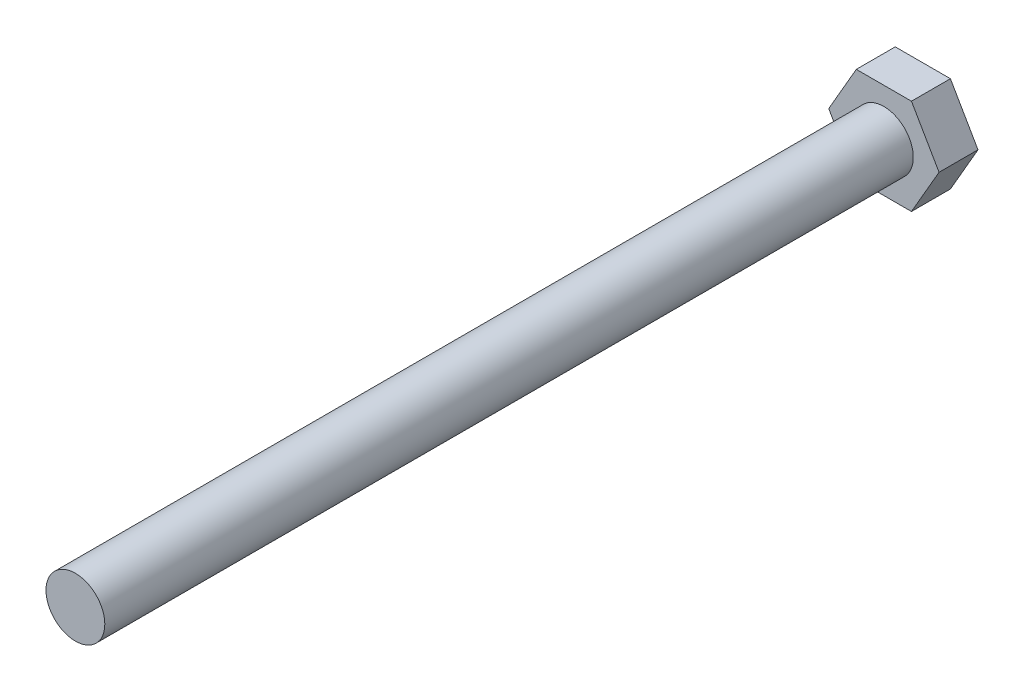
ISO-10303-21;
HEADER;
FILE_DESCRIPTION(('STEP AP214'),'2;1');
FILE_NAME('part.step','',(''),(''),'','','');
FILE_SCHEMA(('AUTOMOTIVE_DESIGN { 1 0 10303 214 1 1 1 1 }'));
ENDSEC;
DATA;
#1=APPLICATION_CONTEXT('core data for automotive mechanical design processes');
#2=APPLICATION_PROTOCOL_DEFINITION('international standard','automotive_design',2000,#1);
#3=PRODUCT_CONTEXT('',#1,'mechanical');
#4=PRODUCT('Part','Part','',(#3));
#5=PRODUCT_RELATED_PRODUCT_CATEGORY('part','',(#4));
#6=PRODUCT_DEFINITION_FORMATION('','',#4);
#7=PRODUCT_DEFINITION_CONTEXT('part definition',#1,'design');
#8=PRODUCT_DEFINITION('design','',#6,#7);
#9=PRODUCT_DEFINITION_SHAPE('','',#8);
#10=(LENGTH_UNIT() NAMED_UNIT(*) SI_UNIT(.MILLI.,.METRE.));
#11=(NAMED_UNIT(*) PLANE_ANGLE_UNIT() SI_UNIT($,.RADIAN.));
#12=(NAMED_UNIT(*) SI_UNIT($,.STERADIAN.) SOLID_ANGLE_UNIT());
#13=UNCERTAINTY_MEASURE_WITH_UNIT(LENGTH_MEASURE(1.E-05),#10,'distance_accuracy_value','');
#14=(GEOMETRIC_REPRESENTATION_CONTEXT(3) GLOBAL_UNCERTAINTY_ASSIGNED_CONTEXT((#13)) GLOBAL_UNIT_ASSIGNED_CONTEXT((#10,
#11,#12)) REPRESENTATION_CONTEXT('',''));
#15=CARTESIAN_POINT('',(0.,0.,0.));
#16=DIRECTION('',(0.,0.,1.));
#17=DIRECTION('',(1.,0.,0.));
#18=AXIS2_PLACEMENT_3D('',#15,#16,#17);
#19=CARTESIAN_POINT('',(3.75277674973257,-6.5,5.3));
#20=DIRECTION('',(0.,0.,-1.));
#21=DIRECTION('',(-1.,0.,0.));
#22=AXIS2_PLACEMENT_3D('',#19,#20,#21);
#23=PLANE('',#22);
#24=DIRECTION('',(0.5,0.866025403784439,0.));
#25=VECTOR('',#24,1.);
#26=CARTESIAN_POINT('',(3.75277674973257,-6.5,5.3));
#27=LINE('',#26,#25);
#28=CARTESIAN_POINT('',(3.75277674973257,-6.5,5.3));
#29=VERTEX_POINT('',#28);
#30=CARTESIAN_POINT('',(7.50555349946513,0.,5.3));
#31=VERTEX_POINT('',#30);
#32=EDGE_CURVE('E136',#29,#31,#27,.T.);
#33=ORIENTED_EDGE('',*,*,#32,.T.);
#34=DIRECTION('',(-0.5,0.866025403784439,0.));
#35=VECTOR('',#34,1.);
#36=CARTESIAN_POINT('',(7.50555349946513,0.,5.3));
#37=LINE('',#36,#35);
#38=CARTESIAN_POINT('',(3.75277674973257,6.5,5.3));
#39=VERTEX_POINT('',#38);
#40=EDGE_CURVE('E94',#31,#39,#37,.T.);
#41=ORIENTED_EDGE('',*,*,#40,.T.);
#42=DIRECTION('',(-1.,0.,0.));
#43=VECTOR('',#42,1.);
#44=CARTESIAN_POINT('',(3.75277674973257,6.5,5.3));
#45=LINE('',#44,#43);
#46=CARTESIAN_POINT('',(-3.75277674973257,6.5,5.3));
#47=VERTEX_POINT('',#46);
#48=EDGE_CURVE('E107',#39,#47,#45,.T.);
#49=ORIENTED_EDGE('',*,*,#48,.T.);
#50=DIRECTION('',(-0.5,-0.866025403784439,0.));
#51=VECTOR('',#50,1.);
#52=CARTESIAN_POINT('',(-3.75277674973257,6.5,5.3));
#53=LINE('',#52,#51);
#54=CARTESIAN_POINT('',(-7.50555349946513,0.,5.3));
#55=VERTEX_POINT('',#54);
#56=EDGE_CURVE('E101',#47,#55,#53,.T.);
#57=ORIENTED_EDGE('',*,*,#56,.T.);
#58=DIRECTION('',(0.5,-0.866025403784439,0.));
#59=VECTOR('',#58,1.);
#60=CARTESIAN_POINT('',(-7.50555349946513,0.,5.3));
#61=LINE('',#60,#59);
#62=CARTESIAN_POINT('',(-3.75277674973257,-6.5,5.3));
#63=VERTEX_POINT('',#62);
#64=EDGE_CURVE('E105',#55,#63,#61,.T.);
#65=ORIENTED_EDGE('',*,*,#64,.T.);
#66=DIRECTION('',(1.,0.,0.));
#67=VECTOR('',#66,1.);
#68=CARTESIAN_POINT('',(-3.75277674973257,-6.5,5.3));
#69=LINE('',#68,#67);
#70=EDGE_CURVE('E56',#63,#29,#69,.T.);
#71=ORIENTED_EDGE('',*,*,#70,.T.);
#72=EDGE_LOOP('',(#33,#41,#49,#57,#65,#71));
#73=FACE_BOUND('',#72,.T.);
#74=CARTESIAN_POINT('',(0.,0.,5.3));
#75=DIRECTION('',(0.,0.,-1.));
#76=DIRECTION('',(-1.,0.,0.));
#77=AXIS2_PLACEMENT_3D('',#74,#75,#76);
#78=CIRCLE('',#77,4.);
#79=CARTESIAN_POINT('',(-4.,0.,5.3));
#80=VERTEX_POINT('',#79);
#81=EDGE_CURVE('E11',#80,#80,#78,.F.);
#82=ORIENTED_EDGE('',*,*,#81,.F.);
#83=EDGE_LOOP('',(#82));
#84=FACE_BOUND('',#83,.T.);
#85=ADVANCED_FACE('F39',(#73,#84),#23,.F.);
#86=CARTESIAN_POINT('',(3.75277674973257,-6.5,5.3));
#87=DIRECTION('',(-0.866025403784439,0.5,0.));
#88=DIRECTION('',(-0.5,-0.866025403784439,0.));
#89=AXIS2_PLACEMENT_3D('',#86,#87,#88);
#90=PLANE('',#89);
#91=DIRECTION('',(0.5,0.866025403784439,0.));
#92=VECTOR('',#91,1.);
#93=CARTESIAN_POINT('',(3.75277674973257,-6.5,0.));
#94=LINE('',#93,#92);
#95=CARTESIAN_POINT('',(3.75277674973257,-6.5,0.));
#96=VERTEX_POINT('',#95);
#97=CARTESIAN_POINT('',(7.50555349946513,0.,0.));
#98=VERTEX_POINT('',#97);
#99=EDGE_CURVE('E125',#96,#98,#94,.T.);
#100=ORIENTED_EDGE('',*,*,#99,.T.);
#101=DIRECTION('',(0.,0.,-1.));
#102=VECTOR('',#101,1.);
#103=CARTESIAN_POINT('',(7.50555349946513,0.,5.3));
#104=LINE('',#103,#102);
#105=EDGE_CURVE('E48',#31,#98,#104,.T.);
#106=ORIENTED_EDGE('',*,*,#105,.F.);
#107=ORIENTED_EDGE('',*,*,#32,.F.);
#108=DIRECTION('',(0.,0.,-1.));
#109=VECTOR('',#108,1.);
#110=CARTESIAN_POINT('',(3.75277674973257,-6.5,5.3));
#111=LINE('',#110,#109);
#112=EDGE_CURVE('E121',#29,#96,#111,.T.);
#113=ORIENTED_EDGE('',*,*,#112,.T.);
#114=EDGE_LOOP('',(#100,#106,#107,#113));
#115=FACE_BOUND('',#114,.T.);
#116=ADVANCED_FACE('F41',(#115),#90,.F.);
#117=CARTESIAN_POINT('',(7.50555349946513,0.,5.3));
#118=DIRECTION('',(-0.866025403784439,-0.5,0.));
#119=DIRECTION('',(0.5,-0.866025403784439,0.));
#120=AXIS2_PLACEMENT_3D('',#117,#118,#119);
#121=PLANE('',#120);
#122=DIRECTION('',(-0.5,0.866025403784439,0.));
#123=VECTOR('',#122,1.);
#124=CARTESIAN_POINT('',(7.50555349946513,0.,0.));
#125=LINE('',#124,#123);
#126=CARTESIAN_POINT('',(3.75277674973257,6.5,0.));
#127=VERTEX_POINT('',#126);
#128=EDGE_CURVE('E128',#98,#127,#125,.T.);
#129=ORIENTED_EDGE('',*,*,#128,.T.);
#130=DIRECTION('',(0.,0.,-1.));
#131=VECTOR('',#130,1.);
#132=CARTESIAN_POINT('',(3.75277674973257,6.5,5.3));
#133=LINE('',#132,#131);
#134=EDGE_CURVE('E140',#39,#127,#133,.T.);
#135=ORIENTED_EDGE('',*,*,#134,.F.);
#136=ORIENTED_EDGE('',*,*,#40,.F.);
#137=ORIENTED_EDGE('',*,*,#105,.T.);
#138=EDGE_LOOP('',(#129,#135,#136,#137));
#139=FACE_BOUND('',#138,.T.);
#140=ADVANCED_FACE('F143',(#139),#121,.F.);
#141=CARTESIAN_POINT('',(3.75277674973257,6.5,5.3));
#142=DIRECTION('',(0.,-1.,0.));
#143=DIRECTION('',(1.,0.,0.));
#144=AXIS2_PLACEMENT_3D('',#141,#142,#143);
#145=PLANE('',#144);
#146=DIRECTION('',(-1.,0.,0.));
#147=VECTOR('',#146,1.);
#148=CARTESIAN_POINT('',(3.75277674973257,6.5,0.));
#149=LINE('',#148,#147);
#150=CARTESIAN_POINT('',(-3.75277674973257,6.5,0.));
#151=VERTEX_POINT('',#150);
#152=EDGE_CURVE('E131',#127,#151,#149,.T.);
#153=ORIENTED_EDGE('',*,*,#152,.T.);
#154=DIRECTION('',(0.,0.,-1.));
#155=VECTOR('',#154,1.);
#156=CARTESIAN_POINT('',(-3.75277674973257,6.5,5.3));
#157=LINE('',#156,#155);
#158=EDGE_CURVE('E116',#47,#151,#157,.T.);
#159=ORIENTED_EDGE('',*,*,#158,.F.);
#160=ORIENTED_EDGE('',*,*,#48,.F.);
#161=ORIENTED_EDGE('',*,*,#134,.T.);
#162=EDGE_LOOP('',(#153,#159,#160,#161));
#163=FACE_BOUND('',#162,.T.);
#164=ADVANCED_FACE('F151',(#163),#145,.F.);
#165=CARTESIAN_POINT('',(-3.75277674973257,6.5,5.3));
#166=DIRECTION('',(0.866025403784439,-0.5,0.));
#167=DIRECTION('',(0.5,0.866025403784439,0.));
#168=AXIS2_PLACEMENT_3D('',#165,#166,#167);
#169=PLANE('',#168);
#170=DIRECTION('',(-0.5,-0.866025403784439,0.));
#171=VECTOR('',#170,1.);
#172=CARTESIAN_POINT('',(-3.75277674973257,6.5,0.));
#173=LINE('',#172,#171);
#174=CARTESIAN_POINT('',(-7.50555349946513,0.,0.));
#175=VERTEX_POINT('',#174);
#176=EDGE_CURVE('E115',#151,#175,#173,.T.);
#177=ORIENTED_EDGE('',*,*,#176,.T.);
#178=DIRECTION('',(0.,0.,-1.));
#179=VECTOR('',#178,1.);
#180=CARTESIAN_POINT('',(-7.50555349946513,0.,5.3));
#181=LINE('',#180,#179);
#182=EDGE_CURVE('E112',#55,#175,#181,.T.);
#183=ORIENTED_EDGE('',*,*,#182,.F.);
#184=ORIENTED_EDGE('',*,*,#56,.F.);
#185=ORIENTED_EDGE('',*,*,#158,.T.);
#186=EDGE_LOOP('',(#177,#183,#184,#185));
#187=FACE_BOUND('',#186,.T.);
#188=ADVANCED_FACE('F113',(#187),#169,.F.);
#189=CARTESIAN_POINT('',(-7.50555349946513,0.,5.3));
#190=DIRECTION('',(0.866025403784439,0.5,0.));
#191=DIRECTION('',(-0.5,0.866025403784439,0.));
#192=AXIS2_PLACEMENT_3D('',#189,#190,#191);
#193=PLANE('',#192);
#194=DIRECTION('',(0.5,-0.866025403784439,0.));
#195=VECTOR('',#194,1.);
#196=CARTESIAN_POINT('',(-7.50555349946513,0.,0.));
#197=LINE('',#196,#195);
#198=CARTESIAN_POINT('',(-3.75277674973257,-6.5,0.));
#199=VERTEX_POINT('',#198);
#200=EDGE_CURVE('E79',#175,#199,#197,.T.);
#201=ORIENTED_EDGE('',*,*,#200,.T.);
#202=DIRECTION('',(0.,0.,-1.));
#203=VECTOR('',#202,1.);
#204=CARTESIAN_POINT('',(-3.75277674973257,-6.5,5.3));
#205=LINE('',#204,#203);
#206=EDGE_CURVE('E117',#63,#199,#205,.T.);
#207=ORIENTED_EDGE('',*,*,#206,.F.);
#208=ORIENTED_EDGE('',*,*,#64,.F.);
#209=ORIENTED_EDGE('',*,*,#182,.T.);
#210=EDGE_LOOP('',(#201,#207,#208,#209));
#211=FACE_BOUND('',#210,.T.);
#212=ADVANCED_FACE('F119',(#211),#193,.F.);
#213=CARTESIAN_POINT('',(-3.75277674973257,-6.5,5.3));
#214=DIRECTION('',(0.,1.,0.));
#215=DIRECTION('',(-1.,0.,0.));
#216=AXIS2_PLACEMENT_3D('',#213,#214,#215);
#217=PLANE('',#216);
#218=DIRECTION('',(1.,0.,0.));
#219=VECTOR('',#218,1.);
#220=CARTESIAN_POINT('',(-3.75277674973257,-6.5,0.));
#221=LINE('',#220,#219);
#222=EDGE_CURVE('E85',#199,#96,#221,.T.);
#223=ORIENTED_EDGE('',*,*,#222,.T.);
#224=ORIENTED_EDGE('',*,*,#112,.F.);
#225=ORIENTED_EDGE('',*,*,#70,.F.);
#226=ORIENTED_EDGE('',*,*,#206,.T.);
#227=EDGE_LOOP('',(#223,#224,#225,#226));
#228=FACE_BOUND('',#227,.T.);
#229=ADVANCED_FACE('F174',(#228),#217,.F.);
#230=CARTESIAN_POINT('',(3.75277674973257,-6.5,0.));
#231=DIRECTION('',(0.,0.,-1.));
#232=DIRECTION('',(-1.,0.,0.));
#233=AXIS2_PLACEMENT_3D('',#230,#231,#232);
#234=PLANE('',#233);
#235=ORIENTED_EDGE('',*,*,#99,.F.);
#236=ORIENTED_EDGE('',*,*,#222,.F.);
#237=ORIENTED_EDGE('',*,*,#200,.F.);
#238=ORIENTED_EDGE('',*,*,#176,.F.);
#239=ORIENTED_EDGE('',*,*,#152,.F.);
#240=ORIENTED_EDGE('',*,*,#128,.F.);
#241=EDGE_LOOP('',(#235,#236,#237,#238,#239,#240));
#242=FACE_BOUND('',#241,.T.);
#243=ADVANCED_FACE('F148',(#242),#234,.T.);
#244=CARTESIAN_POINT('',(0.,0.,115.3));
#245=DIRECTION('',(0.,0.,-1.));
#246=DIRECTION('',(-1.,0.,0.));
#247=AXIS2_PLACEMENT_3D('',#244,#245,#246);
#248=CYLINDRICAL_SURFACE('',#247,4.);
#249=CARTESIAN_POINT('',(0.,0.,115.3));
#250=DIRECTION('',(0.,0.,1.));
#251=DIRECTION('',(1.,0.,0.));
#252=AXIS2_PLACEMENT_3D('',#249,#250,#251);
#253=CIRCLE('',#252,4.);
#254=CARTESIAN_POINT('',(4.,0.,115.3));
#255=VERTEX_POINT('',#254);
#256=EDGE_CURVE('E129',#255,#255,#253,.T.);
#257=ORIENTED_EDGE('',*,*,#256,.F.);
#258=EDGE_LOOP('',(#257));
#259=FACE_BOUND('',#258,.T.);
#260=ORIENTED_EDGE('',*,*,#81,.T.);
#261=EDGE_LOOP('',(#260));
#262=FACE_BOUND('',#261,.T.);
#263=ADVANCED_FACE('F160',(#259,#262),#248,.T.);
#264=CARTESIAN_POINT('',(0.,0.,115.3));
#265=DIRECTION('',(0.,0.,1.));
#266=DIRECTION('',(1.,0.,0.));
#267=AXIS2_PLACEMENT_3D('',#264,#265,#266);
#268=PLANE('',#267);
#269=ORIENTED_EDGE('',*,*,#256,.T.);
#270=EDGE_LOOP('',(#269));
#271=FACE_BOUND('',#270,.T.);
#272=ADVANCED_FACE('F158',(#271),#268,.T.);
#273=CLOSED_SHELL('',(#85,#116,#140,#164,#188,#212,#229,#243,#263,#272));
#274=MANIFOLD_SOLID_BREP('B2',#273);
#275=ADVANCED_BREP_SHAPE_REPRESENTATION('',(#18,#274),#14);
#276=SHAPE_DEFINITION_REPRESENTATION(#9,#275);
ENDSEC;
END-ISO-10303-21;
